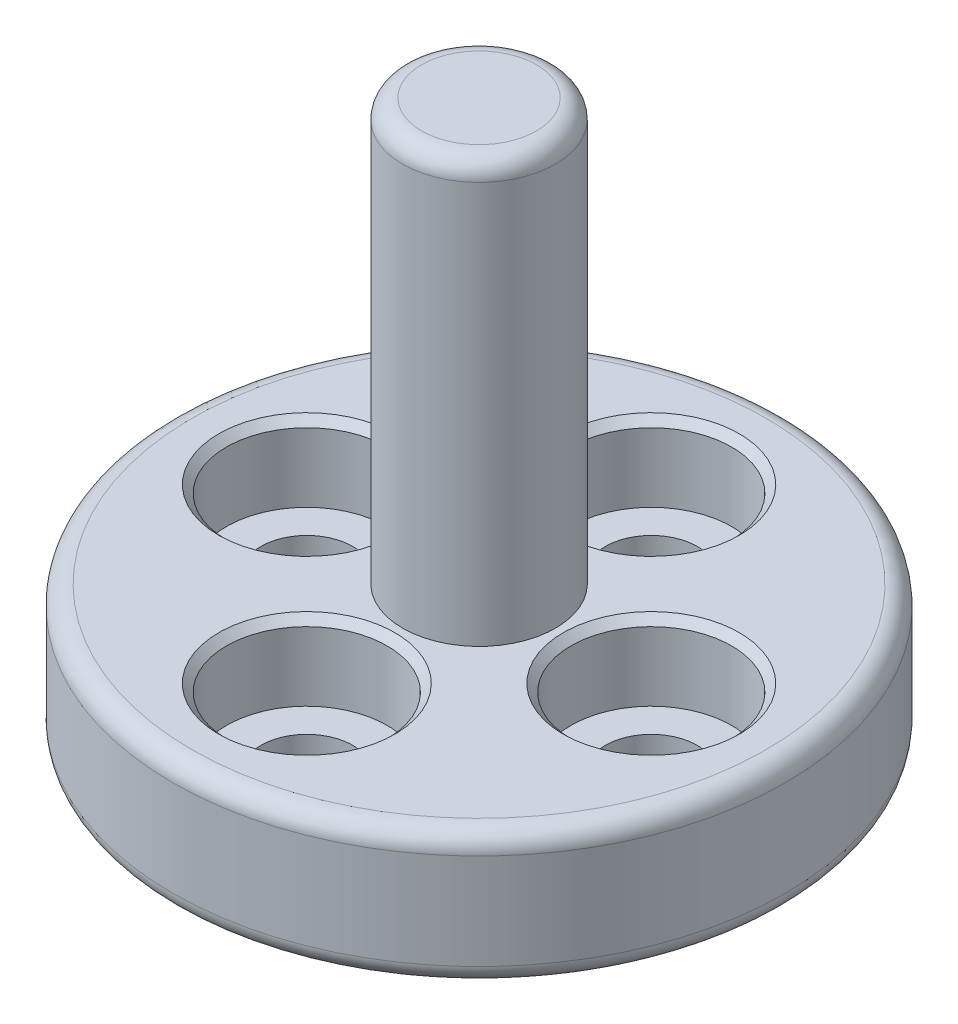
ISO-10303-21;
HEADER;
FILE_DESCRIPTION(('STEP AP214'),'2;1');
FILE_NAME('part.step','',(''),(''),'','','');
FILE_SCHEMA(('AUTOMOTIVE_DESIGN { 1 0 10303 214 1 1 1 1 }'));
ENDSEC;
DATA;
#1=APPLICATION_CONTEXT('core data for automotive mechanical design processes');
#2=APPLICATION_PROTOCOL_DEFINITION('international standard','automotive_design',2000,#1);
#3=PRODUCT_CONTEXT('',#1,'mechanical');
#4=PRODUCT('Part','Part','',(#3));
#5=PRODUCT_RELATED_PRODUCT_CATEGORY('part','',(#4));
#6=PRODUCT_DEFINITION_FORMATION('','',#4);
#7=PRODUCT_DEFINITION_CONTEXT('part definition',#1,'design');
#8=PRODUCT_DEFINITION('design','',#6,#7);
#9=PRODUCT_DEFINITION_SHAPE('','',#8);
#10=(LENGTH_UNIT() NAMED_UNIT(*) SI_UNIT(.MILLI.,.METRE.));
#11=(NAMED_UNIT(*) PLANE_ANGLE_UNIT() SI_UNIT($,.RADIAN.));
#12=(NAMED_UNIT(*) SI_UNIT($,.STERADIAN.) SOLID_ANGLE_UNIT());
#13=UNCERTAINTY_MEASURE_WITH_UNIT(LENGTH_MEASURE(1.E-05),#10,'distance_accuracy_value','');
#14=(GEOMETRIC_REPRESENTATION_CONTEXT(3) GLOBAL_UNCERTAINTY_ASSIGNED_CONTEXT((#13)) GLOBAL_UNIT_ASSIGNED_CONTEXT((#10,
#11,#12)) REPRESENTATION_CONTEXT('',''));
#15=CARTESIAN_POINT('',(0.,0.,0.));
#16=DIRECTION('',(0.,0.,1.));
#17=DIRECTION('',(1.,0.,0.));
#18=AXIS2_PLACEMENT_3D('',#15,#16,#17);
#19=CARTESIAN_POINT('',(-4.49999999999994,0.,0.));
#20=DIRECTION('',(0.,1.,0.));
#21=DIRECTION('',(0.,0.,1.));
#22=AXIS2_PLACEMENT_3D('',#19,#20,#21);
#23=CYLINDRICAL_SURFACE('',#22,1.20000000000012);
#24=CARTESIAN_POINT('',(-4.49999999999994,0.,0.));
#25=DIRECTION('',(0.,1.,0.));
#26=DIRECTION('',(0.,0.,1.));
#27=AXIS2_PLACEMENT_3D('',#24,#25,#26);
#28=CIRCLE('',#27,1.20000000000012);
#29=CARTESIAN_POINT('',(-4.49999999999994,0.,1.20000000000019));
#30=VERTEX_POINT('',#29);
#31=EDGE_CURVE('E108',#30,#30,#28,.T.);
#32=ORIENTED_EDGE('',*,*,#31,.F.);
#33=EDGE_LOOP('',(#32));
#34=FACE_BOUND('',#33,.T.);
#35=CARTESIAN_POINT('',(-4.49999999999994,1.5,0.));
#36=DIRECTION('',(0.,1.,0.));
#37=DIRECTION('',(0.,0.,1.));
#38=AXIS2_PLACEMENT_3D('',#35,#36,#37);
#39=CIRCLE('',#38,1.20000000000012);
#40=CARTESIAN_POINT('',(-4.49999999999994,1.5,1.20000000000019));
#41=VERTEX_POINT('',#40);
#42=EDGE_CURVE('E104',#41,#41,#39,.F.);
#43=ORIENTED_EDGE('',*,*,#42,.F.);
#44=EDGE_LOOP('',(#43));
#45=FACE_BOUND('',#44,.T.);
#46=ADVANCED_FACE('F39',(#34,#45),#23,.F.);
#47=CARTESIAN_POINT('',(1.26244419257969E-13,0.,4.5));
#48=DIRECTION('',(0.,1.,0.));
#49=DIRECTION('',(0.,0.,1.));
#50=AXIS2_PLACEMENT_3D('',#47,#48,#49);
#51=CYLINDRICAL_SURFACE('',#50,1.20000000000015);
#52=CARTESIAN_POINT('',(1.26244419257969E-13,0.,4.5));
#53=DIRECTION('',(0.,1.,0.));
#54=DIRECTION('',(0.,0.,1.));
#55=AXIS2_PLACEMENT_3D('',#52,#53,#54);
#56=CIRCLE('',#55,1.20000000000015);
#57=CARTESIAN_POINT('',(1.26244419257969E-13,0.,5.70000000000015));
#58=VERTEX_POINT('',#57);
#59=EDGE_CURVE('E129',#58,#58,#56,.T.);
#60=ORIENTED_EDGE('',*,*,#59,.F.);
#61=EDGE_LOOP('',(#60));
#62=FACE_BOUND('',#61,.T.);
#63=CARTESIAN_POINT('',(1.26244419257969E-13,1.5,4.5));
#64=DIRECTION('',(0.,1.,0.));
#65=DIRECTION('',(0.,0.,1.));
#66=AXIS2_PLACEMENT_3D('',#63,#64,#65);
#67=CIRCLE('',#66,1.20000000000015);
#68=CARTESIAN_POINT('',(1.26244419257969E-13,1.5,5.70000000000015));
#69=VERTEX_POINT('',#68);
#70=EDGE_CURVE('E109',#69,#69,#67,.F.);
#71=ORIENTED_EDGE('',*,*,#70,.F.);
#72=EDGE_LOOP('',(#71));
#73=FACE_BOUND('',#72,.T.);
#74=ADVANCED_FACE('F174',(#62,#73),#51,.F.);
#75=CARTESIAN_POINT('',(4.5,0.,0.));
#76=DIRECTION('',(0.,1.,0.));
#77=DIRECTION('',(0.,0.,1.));
#78=AXIS2_PLACEMENT_3D('',#75,#76,#77);
#79=CYLINDRICAL_SURFACE('',#78,1.2);
#80=CARTESIAN_POINT('',(4.5,0.,0.));
#81=DIRECTION('',(0.,1.,0.));
#82=DIRECTION('',(0.,0.,1.));
#83=AXIS2_PLACEMENT_3D('',#80,#81,#82);
#84=CIRCLE('',#83,1.2);
#85=CARTESIAN_POINT('',(4.5,0.,1.20000000000002));
#86=VERTEX_POINT('',#85);
#87=EDGE_CURVE('E133',#86,#86,#84,.T.);
#88=ORIENTED_EDGE('',*,*,#87,.F.);
#89=EDGE_LOOP('',(#88));
#90=FACE_BOUND('',#89,.T.);
#91=CARTESIAN_POINT('',(4.5,1.5,0.));
#92=DIRECTION('',(0.,1.,0.));
#93=DIRECTION('',(0.,0.,1.));
#94=AXIS2_PLACEMENT_3D('',#91,#92,#93);
#95=CIRCLE('',#94,1.2);
#96=CARTESIAN_POINT('',(4.5,1.5,1.20000000000002));
#97=VERTEX_POINT('',#96);
#98=EDGE_CURVE('E113',#97,#97,#95,.F.);
#99=ORIENTED_EDGE('',*,*,#98,.F.);
#100=EDGE_LOOP('',(#99));
#101=FACE_BOUND('',#100,.T.);
#102=ADVANCED_FACE('F180',(#90,#101),#79,.F.);
#103=CARTESIAN_POINT('',(0.,0.,-4.5));
#104=DIRECTION('',(0.,1.,0.));
#105=DIRECTION('',(0.,0.,1.));
#106=AXIS2_PLACEMENT_3D('',#103,#104,#105);
#107=CYLINDRICAL_SURFACE('',#106,1.2);
#108=CARTESIAN_POINT('',(0.,0.,-4.5));
#109=DIRECTION('',(0.,1.,0.));
#110=DIRECTION('',(0.,0.,1.));
#111=AXIS2_PLACEMENT_3D('',#108,#109,#110);
#112=CIRCLE('',#111,1.2);
#113=CARTESIAN_POINT('',(0.,0.,-3.3));
#114=VERTEX_POINT('',#113);
#115=EDGE_CURVE('E125',#114,#114,#112,.T.);
#116=ORIENTED_EDGE('',*,*,#115,.F.);
#117=EDGE_LOOP('',(#116));
#118=FACE_BOUND('',#117,.T.);
#119=CARTESIAN_POINT('',(0.,1.5,-4.5));
#120=DIRECTION('',(0.,1.,0.));
#121=DIRECTION('',(0.,0.,1.));
#122=AXIS2_PLACEMENT_3D('',#119,#120,#121);
#123=CIRCLE('',#122,1.2);
#124=CARTESIAN_POINT('',(0.,1.5,-3.3));
#125=VERTEX_POINT('',#124);
#126=EDGE_CURVE('E117',#125,#125,#123,.F.);
#127=ORIENTED_EDGE('',*,*,#126,.F.);
#128=EDGE_LOOP('',(#127));
#129=FACE_BOUND('',#128,.T.);
#130=ADVANCED_FACE('F203',(#118,#129),#107,.F.);
#131=CARTESIAN_POINT('',(0.,3.5,0.));
#132=DIRECTION('',(0.,-1.,0.));
#133=DIRECTION('',(0.,0.,-1.));
#134=AXIS2_PLACEMENT_3D('',#131,#132,#133);
#135=CYLINDRICAL_SURFACE('',#134,8.);
#136=CARTESIAN_POINT('',(0.,0.5,0.));
#137=DIRECTION('',(0.,1.,0.));
#138=DIRECTION('',(0.,0.,1.));
#139=AXIS2_PLACEMENT_3D('',#136,#137,#138);
#140=CIRCLE('',#139,8.);
#141=CARTESIAN_POINT('',(0.,0.5,8.));
#142=VERTEX_POINT('',#141);
#143=EDGE_CURVE('E52',#142,#142,#140,.T.);
#144=ORIENTED_EDGE('',*,*,#143,.T.);
#145=EDGE_LOOP('',(#144));
#146=FACE_BOUND('',#145,.T.);
#147=CARTESIAN_POINT('',(0.,3.,0.));
#148=DIRECTION('',(0.,1.,0.));
#149=DIRECTION('',(0.,0.,1.));
#150=AXIS2_PLACEMENT_3D('',#147,#148,#149);
#151=CIRCLE('',#150,8.);
#152=CARTESIAN_POINT('',(0.,3.,8.));
#153=VERTEX_POINT('',#152);
#154=EDGE_CURVE('E57',#153,#153,#151,.F.);
#155=ORIENTED_EDGE('',*,*,#154,.T.);
#156=EDGE_LOOP('',(#155));
#157=FACE_BOUND('',#156,.T.);
#158=ADVANCED_FACE('F198',(#146,#157),#135,.T.);
#159=CARTESIAN_POINT('',(0.,3.5,0.));
#160=DIRECTION('',(0.,1.,0.));
#161=DIRECTION('',(0.,0.,1.));
#162=AXIS2_PLACEMENT_3D('',#159,#160,#161);
#163=PLANE('',#162);
#164=CARTESIAN_POINT('',(0.,3.5,0.));
#165=DIRECTION('',(0.,1.,0.));
#166=DIRECTION('',(0.,0.,1.));
#167=AXIS2_PLACEMENT_3D('',#164,#165,#166);
#168=CIRCLE('',#167,7.5);
#169=CARTESIAN_POINT('',(0.,3.5,7.5));
#170=VERTEX_POINT('',#169);
#171=EDGE_CURVE('E10',#170,#170,#168,.T.);
#172=ORIENTED_EDGE('',*,*,#171,.T.);
#173=EDGE_LOOP('',(#172));
#174=FACE_BOUND('',#173,.T.);
#175=CARTESIAN_POINT('',(1.26244419257969E-13,3.5,4.5));
#176=DIRECTION('',(0.,1.,0.));
#177=DIRECTION('',(0.,0.,1.));
#178=AXIS2_PLACEMENT_3D('',#175,#176,#177);
#179=CIRCLE('',#178,2.30000000000015);
#180=CARTESIAN_POINT('',(1.26244419257969E-13,3.5,6.80000000000015));
#181=VERTEX_POINT('',#180);
#182=EDGE_CURVE('E83',#181,#181,#179,.F.);
#183=ORIENTED_EDGE('',*,*,#182,.T.);
#184=EDGE_LOOP('',(#183));
#185=FACE_BOUND('',#184,.T.);
#186=CARTESIAN_POINT('',(4.5,3.5,0.));
#187=DIRECTION('',(0.,1.,0.));
#188=DIRECTION('',(0.,0.,1.));
#189=AXIS2_PLACEMENT_3D('',#186,#187,#188);
#190=CIRCLE('',#189,2.3);
#191=CARTESIAN_POINT('',(4.5,3.5,2.30000000000002));
#192=VERTEX_POINT('',#191);
#193=EDGE_CURVE('E87',#192,#192,#190,.F.);
#194=ORIENTED_EDGE('',*,*,#193,.T.);
#195=EDGE_LOOP('',(#194));
#196=FACE_BOUND('',#195,.T.);
#197=CARTESIAN_POINT('',(0.,3.5,-4.5));
#198=DIRECTION('',(0.,1.,0.));
#199=DIRECTION('',(0.,0.,1.));
#200=AXIS2_PLACEMENT_3D('',#197,#198,#199);
#201=CIRCLE('',#200,2.3);
#202=CARTESIAN_POINT('',(0.,3.5,-2.2));
#203=VERTEX_POINT('',#202);
#204=EDGE_CURVE('E91',#203,#203,#201,.F.);
#205=ORIENTED_EDGE('',*,*,#204,.T.);
#206=EDGE_LOOP('',(#205));
#207=FACE_BOUND('',#206,.T.);
#208=CARTESIAN_POINT('',(-4.5,3.5,0.));
#209=DIRECTION('',(0.,1.,0.));
#210=DIRECTION('',(0.,0.,1.));
#211=AXIS2_PLACEMENT_3D('',#208,#209,#210);
#212=CIRCLE('',#211,2.3);
#213=CARTESIAN_POINT('',(-4.5,3.5,2.29999999999995));
#214=VERTEX_POINT('',#213);
#215=EDGE_CURVE('E95',#214,#214,#212,.F.);
#216=ORIENTED_EDGE('',*,*,#215,.T.);
#217=EDGE_LOOP('',(#216));
#218=FACE_BOUND('',#217,.T.);
#219=CARTESIAN_POINT('',(0.,3.5,0.));
#220=DIRECTION('',(0.,1.,0.));
#221=DIRECTION('',(0.,0.,1.));
#222=AXIS2_PLACEMENT_3D('',#219,#220,#221);
#223=CIRCLE('',#222,2.);
#224=CARTESIAN_POINT('',(0.,3.5,2.));
#225=VERTEX_POINT('',#224);
#226=EDGE_CURVE('E103',#225,#225,#223,.T.);
#227=ORIENTED_EDGE('',*,*,#226,.F.);
#228=EDGE_LOOP('',(#227));
#229=FACE_BOUND('',#228,.T.);
#230=ADVANCED_FACE('F195',(#174,#185,#196,#207,#218,#229),#163,.T.);
#231=CARTESIAN_POINT('',(0.,0.,0.));
#232=DIRECTION('',(0.,1.,0.));
#233=DIRECTION('',(0.,0.,1.));
#234=AXIS2_PLACEMENT_3D('',#231,#232,#233);
#235=PLANE('',#234);
#236=CARTESIAN_POINT('',(0.,0.,0.));
#237=DIRECTION('',(0.,1.,0.));
#238=DIRECTION('',(0.,0.,1.));
#239=AXIS2_PLACEMENT_3D('',#236,#237,#238);
#240=CIRCLE('',#239,7.5);
#241=CARTESIAN_POINT('',(0.,0.,7.5));
#242=VERTEX_POINT('',#241);
#243=EDGE_CURVE('E47',#242,#242,#240,.F.);
#244=ORIENTED_EDGE('',*,*,#243,.T.);
#245=EDGE_LOOP('',(#244));
#246=FACE_BOUND('',#245,.T.);
#247=ORIENTED_EDGE('',*,*,#115,.T.);
#248=EDGE_LOOP('',(#247));
#249=FACE_BOUND('',#248,.T.);
#250=ORIENTED_EDGE('',*,*,#87,.T.);
#251=EDGE_LOOP('',(#250));
#252=FACE_BOUND('',#251,.T.);
#253=ORIENTED_EDGE('',*,*,#59,.T.);
#254=EDGE_LOOP('',(#253));
#255=FACE_BOUND('',#254,.T.);
#256=ORIENTED_EDGE('',*,*,#31,.T.);
#257=EDGE_LOOP('',(#256));
#258=FACE_BOUND('',#257,.T.);
#259=ADVANCED_FACE('F193',(#246,#249,#252,#255,#258),#235,.F.);
#260=CARTESIAN_POINT('',(0.,14.5,0.));
#261=DIRECTION('',(0.,-1.,0.));
#262=DIRECTION('',(0.,0.,-1.));
#263=AXIS2_PLACEMENT_3D('',#260,#261,#262);
#264=CYLINDRICAL_SURFACE('',#263,2.);
#265=CARTESIAN_POINT('',(0.,14.,0.));
#266=DIRECTION('',(0.,1.,0.));
#267=DIRECTION('',(0.,0.,1.));
#268=AXIS2_PLACEMENT_3D('',#265,#266,#267);
#269=CIRCLE('',#268,2.);
#270=CARTESIAN_POINT('',(0.,14.,2.));
#271=VERTEX_POINT('',#270);
#272=EDGE_CURVE('E63',#271,#271,#269,.F.);
#273=ORIENTED_EDGE('',*,*,#272,.T.);
#274=EDGE_LOOP('',(#273));
#275=FACE_BOUND('',#274,.T.);
#276=ORIENTED_EDGE('',*,*,#226,.T.);
#277=EDGE_LOOP('',(#276));
#278=FACE_BOUND('',#277,.T.);
#279=ADVANCED_FACE('F189',(#275,#278),#264,.T.);
#280=CARTESIAN_POINT('',(0.,14.5,0.));
#281=DIRECTION('',(0.,1.,0.));
#282=DIRECTION('',(0.,0.,1.));
#283=AXIS2_PLACEMENT_3D('',#280,#281,#282);
#284=PLANE('',#283);
#285=CARTESIAN_POINT('',(0.,14.5,0.));
#286=DIRECTION('',(0.,1.,0.));
#287=DIRECTION('',(0.,0.,1.));
#288=AXIS2_PLACEMENT_3D('',#285,#286,#287);
#289=CIRCLE('',#288,1.5);
#290=CARTESIAN_POINT('',(0.,14.5,1.5));
#291=VERTEX_POINT('',#290);
#292=EDGE_CURVE('E67',#291,#291,#289,.T.);
#293=ORIENTED_EDGE('',*,*,#292,.T.);
#294=EDGE_LOOP('',(#293));
#295=FACE_BOUND('',#294,.T.);
#296=ADVANCED_FACE('F171',(#295),#284,.T.);
#297=CARTESIAN_POINT('',(0.,1.5,-4.5));
#298=DIRECTION('',(0.,1.,0.));
#299=DIRECTION('',(0.,0.,1.));
#300=AXIS2_PLACEMENT_3D('',#297,#298,#299);
#301=PLANE('',#300);
#302=CARTESIAN_POINT('',(0.,1.5,-4.5));
#303=DIRECTION('',(0.,1.,0.));
#304=DIRECTION('',(0.,0.,1.));
#305=AXIS2_PLACEMENT_3D('',#302,#303,#304);
#306=CIRCLE('',#305,2.1);
#307=CARTESIAN_POINT('',(0.,1.5,-2.4));
#308=VERTEX_POINT('',#307);
#309=EDGE_CURVE('E121',#308,#308,#306,.T.);
#310=ORIENTED_EDGE('',*,*,#309,.T.);
#311=EDGE_LOOP('',(#310));
#312=FACE_BOUND('',#311,.T.);
#313=ORIENTED_EDGE('',*,*,#126,.T.);
#314=EDGE_LOOP('',(#313));
#315=FACE_BOUND('',#314,.T.);
#316=ADVANCED_FACE('F156',(#312,#315),#301,.T.);
#317=CARTESIAN_POINT('',(0.,1.5,-4.5));
#318=DIRECTION('',(0.,1.,0.));
#319=DIRECTION('',(0.,0.,1.));
#320=AXIS2_PLACEMENT_3D('',#317,#318,#319);
#321=CYLINDRICAL_SURFACE('',#320,2.1);
#322=CARTESIAN_POINT('',(0.,3.3,-4.5));
#323=DIRECTION('',(0.,1.,0.));
#324=DIRECTION('',(0.,0.,1.));
#325=AXIS2_PLACEMENT_3D('',#322,#323,#324);
#326=CIRCLE('',#325,2.1);
#327=CARTESIAN_POINT('',(0.,3.3,-2.4));
#328=VERTEX_POINT('',#327);
#329=EDGE_CURVE('E75',#328,#328,#326,.T.);
#330=ORIENTED_EDGE('',*,*,#329,.T.);
#331=EDGE_LOOP('',(#330));
#332=FACE_BOUND('',#331,.T.);
#333=ORIENTED_EDGE('',*,*,#309,.F.);
#334=EDGE_LOOP('',(#333));
#335=FACE_BOUND('',#334,.T.);
#336=ADVANCED_FACE('F159',(#332,#335),#321,.F.);
#337=CARTESIAN_POINT('',(4.5,1.5,0.));
#338=DIRECTION('',(0.,1.,0.));
#339=DIRECTION('',(0.,0.,1.));
#340=AXIS2_PLACEMENT_3D('',#337,#338,#339);
#341=PLANE('',#340);
#342=CARTESIAN_POINT('',(4.5,1.5,0.));
#343=DIRECTION('',(0.,1.,0.));
#344=DIRECTION('',(0.,0.,1.));
#345=AXIS2_PLACEMENT_3D('',#342,#343,#344);
#346=CIRCLE('',#345,2.1);
#347=CARTESIAN_POINT('',(4.5,1.5,2.10000000000002));
#348=VERTEX_POINT('',#347);
#349=EDGE_CURVE('E148',#348,#348,#346,.T.);
#350=ORIENTED_EDGE('',*,*,#349,.T.);
#351=EDGE_LOOP('',(#350));
#352=FACE_BOUND('',#351,.T.);
#353=ORIENTED_EDGE('',*,*,#98,.T.);
#354=EDGE_LOOP('',(#353));
#355=FACE_BOUND('',#354,.T.);
#356=ADVANCED_FACE('F161',(#352,#355),#341,.T.);
#357=CARTESIAN_POINT('',(4.5,1.5,0.));
#358=DIRECTION('',(0.,1.,0.));
#359=DIRECTION('',(0.,0.,1.));
#360=AXIS2_PLACEMENT_3D('',#357,#358,#359);
#361=CYLINDRICAL_SURFACE('',#360,2.1);
#362=CARTESIAN_POINT('',(4.5,3.3,0.));
#363=DIRECTION('',(0.,1.,0.));
#364=DIRECTION('',(0.,0.,1.));
#365=AXIS2_PLACEMENT_3D('',#362,#363,#364);
#366=CIRCLE('',#365,2.1);
#367=CARTESIAN_POINT('',(4.5,3.3,2.10000000000002));
#368=VERTEX_POINT('',#367);
#369=EDGE_CURVE('E79',#368,#368,#366,.T.);
#370=ORIENTED_EDGE('',*,*,#369,.T.);
#371=EDGE_LOOP('',(#370));
#372=FACE_BOUND('',#371,.T.);
#373=ORIENTED_EDGE('',*,*,#349,.F.);
#374=EDGE_LOOP('',(#373));
#375=FACE_BOUND('',#374,.T.);
#376=ADVANCED_FACE('F168',(#372,#375),#361,.F.);
#377=CARTESIAN_POINT('',(1.26244419257969E-13,1.5,4.5));
#378=DIRECTION('',(0.,1.,0.));
#379=DIRECTION('',(0.,0.,1.));
#380=AXIS2_PLACEMENT_3D('',#377,#378,#379);
#381=PLANE('',#380);
#382=CARTESIAN_POINT('',(1.26244419257969E-13,1.5,4.5));
#383=DIRECTION('',(0.,1.,0.));
#384=DIRECTION('',(0.,0.,1.));
#385=AXIS2_PLACEMENT_3D('',#382,#383,#384);
#386=CIRCLE('',#385,2.10000000000015);
#387=CARTESIAN_POINT('',(1.26244419257969E-13,1.5,6.60000000000015));
#388=VERTEX_POINT('',#387);
#389=EDGE_CURVE('E144',#388,#388,#386,.T.);
#390=ORIENTED_EDGE('',*,*,#389,.T.);
#391=EDGE_LOOP('',(#390));
#392=FACE_BOUND('',#391,.T.);
#393=ORIENTED_EDGE('',*,*,#70,.T.);
#394=EDGE_LOOP('',(#393));
#395=FACE_BOUND('',#394,.T.);
#396=ADVANCED_FACE('F339',(#392,#395),#381,.T.);
#397=CARTESIAN_POINT('',(1.26244419257969E-13,1.5,4.5));
#398=DIRECTION('',(0.,1.,0.));
#399=DIRECTION('',(0.,0.,1.));
#400=AXIS2_PLACEMENT_3D('',#397,#398,#399);
#401=CYLINDRICAL_SURFACE('',#400,2.10000000000015);
#402=CARTESIAN_POINT('',(1.26244419257969E-13,3.3,4.5));
#403=DIRECTION('',(0.,1.,0.));
#404=DIRECTION('',(0.,0.,1.));
#405=AXIS2_PLACEMENT_3D('',#402,#403,#404);
#406=CIRCLE('',#405,2.10000000000015);
#407=CARTESIAN_POINT('',(1.26244419257969E-13,3.3,6.60000000000015));
#408=VERTEX_POINT('',#407);
#409=EDGE_CURVE('E99',#408,#408,#406,.T.);
#410=ORIENTED_EDGE('',*,*,#409,.T.);
#411=EDGE_LOOP('',(#410));
#412=FACE_BOUND('',#411,.T.);
#413=ORIENTED_EDGE('',*,*,#389,.F.);
#414=EDGE_LOOP('',(#413));
#415=FACE_BOUND('',#414,.T.);
#416=ADVANCED_FACE('F334',(#412,#415),#401,.F.);
#417=CARTESIAN_POINT('',(-4.5,1.5,0.));
#418=DIRECTION('',(0.,1.,0.));
#419=DIRECTION('',(0.,0.,1.));
#420=AXIS2_PLACEMENT_3D('',#417,#418,#419);
#421=PLANE('',#420);
#422=CARTESIAN_POINT('',(-4.5,1.5,0.));
#423=DIRECTION('',(0.,1.,0.));
#424=DIRECTION('',(0.,0.,1.));
#425=AXIS2_PLACEMENT_3D('',#422,#423,#424);
#426=CIRCLE('',#425,2.1);
#427=CARTESIAN_POINT('',(-4.5,1.5,2.09999999999995));
#428=VERTEX_POINT('',#427);
#429=EDGE_CURVE('E140',#428,#428,#426,.T.);
#430=ORIENTED_EDGE('',*,*,#429,.T.);
#431=EDGE_LOOP('',(#430));
#432=FACE_BOUND('',#431,.T.);
#433=ORIENTED_EDGE('',*,*,#42,.T.);
#434=EDGE_LOOP('',(#433));
#435=FACE_BOUND('',#434,.T.);
#436=ADVANCED_FACE('F326',(#432,#435),#421,.T.);
#437=CARTESIAN_POINT('',(-4.5,1.5,0.));
#438=DIRECTION('',(0.,1.,0.));
#439=DIRECTION('',(0.,0.,1.));
#440=AXIS2_PLACEMENT_3D('',#437,#438,#439);
#441=CYLINDRICAL_SURFACE('',#440,2.1);
#442=CARTESIAN_POINT('',(-4.5,3.3,0.));
#443=DIRECTION('',(0.,1.,0.));
#444=DIRECTION('',(0.,0.,1.));
#445=AXIS2_PLACEMENT_3D('',#442,#443,#444);
#446=CIRCLE('',#445,2.1);
#447=CARTESIAN_POINT('',(-4.5,3.3,2.09999999999995));
#448=VERTEX_POINT('',#447);
#449=EDGE_CURVE('E71',#448,#448,#446,.T.);
#450=ORIENTED_EDGE('',*,*,#449,.T.);
#451=EDGE_LOOP('',(#450));
#452=FACE_BOUND('',#451,.T.);
#453=ORIENTED_EDGE('',*,*,#429,.F.);
#454=EDGE_LOOP('',(#453));
#455=FACE_BOUND('',#454,.T.);
#456=ADVANCED_FACE('F213',(#452,#455),#441,.F.);
#457=CARTESIAN_POINT('',(1.26244419257969E-13,3.3,4.5));
#458=DIRECTION('',(0.,1.,0.));
#459=DIRECTION('',(0.,0.,1.));
#460=AXIS2_PLACEMENT_3D('',#457,#458,#459);
#461=CONICAL_SURFACE('',#460,2.10000000000015,0.785398163397446);
#462=ORIENTED_EDGE('',*,*,#182,.F.);
#463=EDGE_LOOP('',(#462));
#464=FACE_BOUND('',#463,.T.);
#465=ORIENTED_EDGE('',*,*,#409,.F.);
#466=EDGE_LOOP('',(#465));
#467=FACE_BOUND('',#466,.T.);
#468=ADVANCED_FACE('F206',(#464,#467),#461,.F.);
#469=CARTESIAN_POINT('',(4.5,3.3,0.));
#470=DIRECTION('',(0.,1.,0.));
#471=DIRECTION('',(0.,0.,1.));
#472=AXIS2_PLACEMENT_3D('',#469,#470,#471);
#473=CONICAL_SURFACE('',#472,2.1,0.785398163397455);
#474=ORIENTED_EDGE('',*,*,#193,.F.);
#475=EDGE_LOOP('',(#474));
#476=FACE_BOUND('',#475,.T.);
#477=ORIENTED_EDGE('',*,*,#369,.F.);
#478=EDGE_LOOP('',(#477));
#479=FACE_BOUND('',#478,.T.);
#480=ADVANCED_FACE('F212',(#476,#479),#473,.F.);
#481=CARTESIAN_POINT('',(0.,3.3,-4.5));
#482=DIRECTION('',(0.,1.,0.));
#483=DIRECTION('',(0.,0.,1.));
#484=AXIS2_PLACEMENT_3D('',#481,#482,#483);
#485=CONICAL_SURFACE('',#484,2.1,0.785398163397455);
#486=ORIENTED_EDGE('',*,*,#204,.F.);
#487=EDGE_LOOP('',(#486));
#488=FACE_BOUND('',#487,.T.);
#489=ORIENTED_EDGE('',*,*,#329,.F.);
#490=EDGE_LOOP('',(#489));
#491=FACE_BOUND('',#490,.T.);
#492=ADVANCED_FACE('F220',(#488,#491),#485,.F.);
#493=CARTESIAN_POINT('',(-4.5,3.3,0.));
#494=DIRECTION('',(0.,1.,0.));
#495=DIRECTION('',(0.,0.,1.));
#496=AXIS2_PLACEMENT_3D('',#493,#494,#495);
#497=CONICAL_SURFACE('',#496,2.1,0.785398163397455);
#498=ORIENTED_EDGE('',*,*,#215,.F.);
#499=EDGE_LOOP('',(#498));
#500=FACE_BOUND('',#499,.T.);
#501=ORIENTED_EDGE('',*,*,#449,.F.);
#502=EDGE_LOOP('',(#501));
#503=FACE_BOUND('',#502,.T.);
#504=ADVANCED_FACE('F227',(#500,#503),#497,.F.);
#505=CARTESIAN_POINT('',(0.,14.,0.));
#506=DIRECTION('',(0.,1.,0.));
#507=DIRECTION('',(0.,0.,1.));
#508=AXIS2_PLACEMENT_3D('',#505,#506,#507);
#509=TOROIDAL_SURFACE('',#508,1.5,0.5);
#510=ORIENTED_EDGE('',*,*,#272,.F.);
#511=EDGE_LOOP('',(#510));
#512=FACE_BOUND('',#511,.T.);
#513=ORIENTED_EDGE('',*,*,#292,.F.);
#514=EDGE_LOOP('',(#513));
#515=FACE_BOUND('',#514,.T.);
#516=ADVANCED_FACE('F233',(#512,#515),#509,.T.);
#517=CARTESIAN_POINT('',(0.,0.5,0.));
#518=DIRECTION('',(0.,1.,0.));
#519=DIRECTION('',(0.,0.,1.));
#520=AXIS2_PLACEMENT_3D('',#517,#518,#519);
#521=TOROIDAL_SURFACE('',#520,7.5,0.5);
#522=ORIENTED_EDGE('',*,*,#243,.F.);
#523=EDGE_LOOP('',(#522));
#524=FACE_BOUND('',#523,.T.);
#525=ORIENTED_EDGE('',*,*,#143,.F.);
#526=EDGE_LOOP('',(#525));
#527=FACE_BOUND('',#526,.T.);
#528=ADVANCED_FACE('F236',(#524,#527),#521,.T.);
#529=CARTESIAN_POINT('',(0.,3.,0.));
#530=DIRECTION('',(0.,1.,0.));
#531=DIRECTION('',(0.,0.,1.));
#532=AXIS2_PLACEMENT_3D('',#529,#530,#531);
#533=TOROIDAL_SURFACE('',#532,7.5,0.5);
#534=ORIENTED_EDGE('',*,*,#154,.F.);
#535=EDGE_LOOP('',(#534));
#536=FACE_BOUND('',#535,.T.);
#537=ORIENTED_EDGE('',*,*,#171,.F.);
#538=EDGE_LOOP('',(#537));
#539=FACE_BOUND('',#538,.T.);
#540=ADVANCED_FACE('F41',(#536,#539),#533,.T.);
#541=CLOSED_SHELL('',(#46,#74,#102,#130,#158,#230,#259,#279,#296,#316,#336,#356,#376,#396,#416,
#436,#456,#468,#480,#492,#504,#516,#528,#540));
#542=MANIFOLD_SOLID_BREP('B2',#541);
#543=ADVANCED_BREP_SHAPE_REPRESENTATION('',(#18,#542),#14);
#544=SHAPE_DEFINITION_REPRESENTATION(#9,#543);
ENDSEC;
END-ISO-10303-21;
